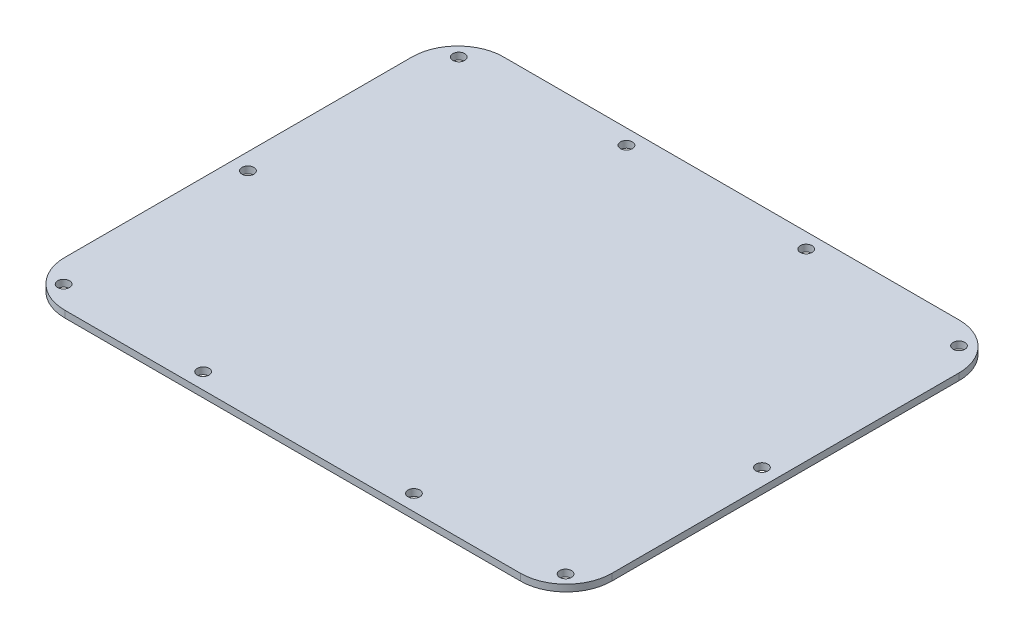
ISO-10303-21;
HEADER;
FILE_DESCRIPTION(('STEP AP214'),'2;1');
FILE_NAME('part.step','',(''),(''),'','','');
FILE_SCHEMA(('AUTOMOTIVE_DESIGN { 1 0 10303 214 1 1 1 1 }'));
ENDSEC;
DATA;
#1=APPLICATION_CONTEXT('core data for automotive mechanical design processes');
#2=APPLICATION_PROTOCOL_DEFINITION('international standard','automotive_design',2000,#1);
#3=PRODUCT_CONTEXT('',#1,'mechanical');
#4=PRODUCT('Part','Part','',(#3));
#5=PRODUCT_RELATED_PRODUCT_CATEGORY('part','',(#4));
#6=PRODUCT_DEFINITION_FORMATION('','',#4);
#7=PRODUCT_DEFINITION_CONTEXT('part definition',#1,'design');
#8=PRODUCT_DEFINITION('design','',#6,#7);
#9=PRODUCT_DEFINITION_SHAPE('','',#8);
#10=(LENGTH_UNIT() NAMED_UNIT(*) SI_UNIT(.MILLI.,.METRE.));
#11=(NAMED_UNIT(*) PLANE_ANGLE_UNIT() SI_UNIT($,.RADIAN.));
#12=(NAMED_UNIT(*) SI_UNIT($,.STERADIAN.) SOLID_ANGLE_UNIT());
#13=UNCERTAINTY_MEASURE_WITH_UNIT(LENGTH_MEASURE(1.E-05),#10,'distance_accuracy_value','');
#14=(GEOMETRIC_REPRESENTATION_CONTEXT(3) GLOBAL_UNCERTAINTY_ASSIGNED_CONTEXT((#13)) GLOBAL_UNIT_ASSIGNED_CONTEXT((#10,
#11,#12)) REPRESENTATION_CONTEXT('',''));
#15=CARTESIAN_POINT('',(0.,0.,0.));
#16=DIRECTION('',(0.,0.,1.));
#17=DIRECTION('',(1.,0.,0.));
#18=AXIS2_PLACEMENT_3D('',#15,#16,#17);
#19=CARTESIAN_POINT('',(-106.7689,3.175,81.3689000000001));
#20=DIRECTION('',(0.,-1.,0.));
#21=DIRECTION('',(0.,0.,-1.));
#22=AXIS2_PLACEMENT_3D('',#19,#20,#21);
#23=PLANE('',#22);
#24=CARTESIAN_POINT('',(-106.7689,3.175,81.3689000000001));
#25=DIRECTION('',(0.,1.,0.));
#26=DIRECTION('',(0.,0.,-1.));
#27=AXIS2_PLACEMENT_3D('',#24,#25,#26);
#28=CIRCLE('',#27,21.4376);
#29=CARTESIAN_POINT('',(-128.2065,3.175,81.3688999999999));
#30=VERTEX_POINT('',#29);
#31=CARTESIAN_POINT('',(-106.7689,3.175,102.8065));
#32=VERTEX_POINT('',#31);
#33=EDGE_CURVE('E170',#30,#32,#28,.T.);
#34=ORIENTED_EDGE('',*,*,#33,.T.);
#35=DIRECTION('',(1.,0.,0.));
#36=VECTOR('',#35,1.);
#37=CARTESIAN_POINT('',(-106.7689,3.175,102.8065));
#38=LINE('',#37,#36);
#39=CARTESIAN_POINT('',(106.7689,3.175,102.8065));
#40=VERTEX_POINT('',#39);
#41=EDGE_CURVE('E106',#32,#40,#38,.T.);
#42=ORIENTED_EDGE('',*,*,#41,.T.);
#43=CARTESIAN_POINT('',(106.7689,3.175,81.3689000000001));
#44=DIRECTION('',(0.,1.,0.));
#45=DIRECTION('',(0.,0.,1.));
#46=AXIS2_PLACEMENT_3D('',#43,#44,#45);
#47=CIRCLE('',#46,21.4376);
#48=CARTESIAN_POINT('',(128.2065,3.175,81.3688999999999));
#49=VERTEX_POINT('',#48);
#50=EDGE_CURVE('E191',#40,#49,#47,.T.);
#51=ORIENTED_EDGE('',*,*,#50,.T.);
#52=DIRECTION('',(0.,0.,-1.));
#53=VECTOR('',#52,1.);
#54=CARTESIAN_POINT('',(128.2065,3.175,81.3688999999999));
#55=LINE('',#54,#53);
#56=CARTESIAN_POINT('',(128.2065,3.175,-81.3688999999998));
#57=VERTEX_POINT('',#56);
#58=EDGE_CURVE('E205',#49,#57,#55,.T.);
#59=ORIENTED_EDGE('',*,*,#58,.T.);
#60=CARTESIAN_POINT('',(106.7689,3.175,-81.3689));
#61=DIRECTION('',(0.,1.,0.));
#62=DIRECTION('',(0.,0.,-1.));
#63=AXIS2_PLACEMENT_3D('',#60,#61,#62);
#64=CIRCLE('',#63,21.4376);
#65=CARTESIAN_POINT('',(106.7689,3.175,-102.8065));
#66=VERTEX_POINT('',#65);
#67=EDGE_CURVE('E125',#57,#66,#64,.T.);
#68=ORIENTED_EDGE('',*,*,#67,.T.);
#69=DIRECTION('',(-1.,0.,0.));
#70=VECTOR('',#69,1.);
#71=CARTESIAN_POINT('',(-106.7689,3.175,-102.8065));
#72=LINE('',#71,#70);
#73=CARTESIAN_POINT('',(-106.7689,3.175,-102.8065));
#74=VERTEX_POINT('',#73);
#75=EDGE_CURVE('E119',#66,#74,#72,.T.);
#76=ORIENTED_EDGE('',*,*,#75,.T.);
#77=CARTESIAN_POINT('',(-106.7689,3.175,-81.3689));
#78=DIRECTION('',(0.,1.,0.));
#79=DIRECTION('',(0.,0.,-1.));
#80=AXIS2_PLACEMENT_3D('',#77,#78,#79);
#81=CIRCLE('',#80,21.4376);
#82=CARTESIAN_POINT('',(-128.2065,3.175,-81.3688999999998));
#83=VERTEX_POINT('',#82);
#84=EDGE_CURVE('E123',#74,#83,#81,.T.);
#85=ORIENTED_EDGE('',*,*,#84,.T.);
#86=DIRECTION('',(0.,0.,1.));
#87=VECTOR('',#86,1.);
#88=CARTESIAN_POINT('',(-128.2065,3.175,81.3688999999999));
#89=LINE('',#88,#87);
#90=EDGE_CURVE('E63',#83,#30,#89,.T.);
#91=ORIENTED_EDGE('',*,*,#90,.T.);
#92=EDGE_LOOP('',(#34,#42,#51,#59,#68,#76,#85,#91));
#93=FACE_BOUND('',#92,.T.);
#94=CARTESIAN_POINT('',(42.1132,3.175,-95.7453));
#95=DIRECTION('',(0.,1.,0.));
#96=DIRECTION('',(0.,0.,1.));
#97=AXIS2_PLACEMENT_3D('',#94,#95,#96);
#98=CIRCLE('',#97,2.7813);
#99=CARTESIAN_POINT('',(42.1132,3.175,-92.964));
#100=VERTEX_POINT('',#99);
#101=EDGE_CURVE('E152',#100,#100,#98,.T.);
#102=ORIENTED_EDGE('',*,*,#101,.F.);
#103=EDGE_LOOP('',(#102));
#104=FACE_BOUND('',#103,.T.);
#105=CARTESIAN_POINT('',(117.221,3.175,-92.2909));
#106=DIRECTION('',(0.,1.,0.));
#107=DIRECTION('',(0.,0.,1.));
#108=AXIS2_PLACEMENT_3D('',#105,#106,#107);
#109=CIRCLE('',#108,2.7813);
#110=CARTESIAN_POINT('',(117.221,3.175,-89.5096));
#111=VERTEX_POINT('',#110);
#112=EDGE_CURVE('E219',#111,#111,#109,.T.);
#113=ORIENTED_EDGE('',*,*,#112,.F.);
#114=EDGE_LOOP('',(#113));
#115=FACE_BOUND('',#114,.T.);
#116=CARTESIAN_POINT('',(117.6274,3.175,92.5195));
#117=DIRECTION('',(0.,1.,0.));
#118=DIRECTION('',(0.,0.,1.));
#119=AXIS2_PLACEMENT_3D('',#116,#117,#118);
#120=CIRCLE('',#119,2.7813);
#121=CARTESIAN_POINT('',(117.6274,3.175,95.3008));
#122=VERTEX_POINT('',#121);
#123=EDGE_CURVE('E227',#122,#122,#120,.T.);
#124=ORIENTED_EDGE('',*,*,#123,.F.);
#125=EDGE_LOOP('',(#124));
#126=FACE_BOUND('',#125,.T.);
#127=CARTESIAN_POINT('',(120.4468,3.175,3.3147));
#128=DIRECTION('',(0.,1.,0.));
#129=DIRECTION('',(0.,0.,1.));
#130=AXIS2_PLACEMENT_3D('',#127,#128,#129);
#131=CIRCLE('',#130,2.7813);
#132=CARTESIAN_POINT('',(120.4468,3.175,6.096));
#133=VERTEX_POINT('',#132);
#134=EDGE_CURVE('E235',#133,#133,#131,.T.);
#135=ORIENTED_EDGE('',*,*,#134,.F.);
#136=EDGE_LOOP('',(#135));
#137=FACE_BOUND('',#136,.T.);
#138=CARTESIAN_POINT('',(49.403,3.175,95.3643));
#139=DIRECTION('',(0.,1.,0.));
#140=DIRECTION('',(0.,0.,1.));
#141=AXIS2_PLACEMENT_3D('',#138,#139,#140);
#142=CIRCLE('',#141,2.7813);
#143=CARTESIAN_POINT('',(49.403,3.175,98.1456));
#144=VERTEX_POINT('',#143);
#145=EDGE_CURVE('E243',#144,#144,#142,.T.);
#146=ORIENTED_EDGE('',*,*,#145,.F.);
#147=EDGE_LOOP('',(#146));
#148=FACE_BOUND('',#147,.T.);
#149=CARTESIAN_POINT('',(-49.4030000000002,3.175,95.3643));
#150=DIRECTION('',(0.,1.,0.));
#151=DIRECTION('',(0.,0.,-1.));
#152=AXIS2_PLACEMENT_3D('',#149,#150,#151);
#153=CIRCLE('',#152,2.7813);
#154=CARTESIAN_POINT('',(-49.4030000000002,3.175,92.583));
#155=VERTEX_POINT('',#154);
#156=EDGE_CURVE('E251',#155,#155,#153,.T.);
#157=ORIENTED_EDGE('',*,*,#156,.F.);
#158=EDGE_LOOP('',(#157));
#159=FACE_BOUND('',#158,.T.);
#160=CARTESIAN_POINT('',(-117.6274,3.175,92.5195));
#161=DIRECTION('',(0.,1.,0.));
#162=DIRECTION('',(0.,0.,-1.));
#163=AXIS2_PLACEMENT_3D('',#160,#161,#162);
#164=CIRCLE('',#163,2.7813);
#165=CARTESIAN_POINT('',(-117.6274,3.175,89.7381999999999));
#166=VERTEX_POINT('',#165);
#167=EDGE_CURVE('E259',#166,#166,#164,.T.);
#168=ORIENTED_EDGE('',*,*,#167,.F.);
#169=EDGE_LOOP('',(#168));
#170=FACE_BOUND('',#169,.T.);
#171=CARTESIAN_POINT('',(-120.4468,3.175,3.3147));
#172=DIRECTION('',(0.,1.,0.));
#173=DIRECTION('',(0.,0.,-1.));
#174=AXIS2_PLACEMENT_3D('',#171,#172,#173);
#175=CIRCLE('',#174,2.7813);
#176=CARTESIAN_POINT('',(-120.4468,3.175,0.533400000000007));
#177=VERTEX_POINT('',#176);
#178=EDGE_CURVE('E267',#177,#177,#175,.T.);
#179=ORIENTED_EDGE('',*,*,#178,.F.);
#180=EDGE_LOOP('',(#179));
#181=FACE_BOUND('',#180,.T.);
#182=CARTESIAN_POINT('',(-117.221,3.175,-92.2908999999999));
#183=DIRECTION('',(0.,1.,0.));
#184=DIRECTION('',(0.,0.,-1.));
#185=AXIS2_PLACEMENT_3D('',#182,#183,#184);
#186=CIRCLE('',#185,2.7813);
#187=CARTESIAN_POINT('',(-117.221,3.175,-95.0721999999999));
#188=VERTEX_POINT('',#187);
#189=EDGE_CURVE('E275',#188,#188,#186,.T.);
#190=ORIENTED_EDGE('',*,*,#189,.F.);
#191=EDGE_LOOP('',(#190));
#192=FACE_BOUND('',#191,.T.);
#193=CARTESIAN_POINT('',(-42.1132000000002,3.175,-95.7452999999999));
#194=DIRECTION('',(0.,1.,0.));
#195=DIRECTION('',(0.,0.,-1.));
#196=AXIS2_PLACEMENT_3D('',#193,#194,#195);
#197=CIRCLE('',#196,2.7813);
#198=CARTESIAN_POINT('',(-42.1132000000002,3.175,-98.5265999999999));
#199=VERTEX_POINT('',#198);
#200=EDGE_CURVE('E283',#199,#199,#197,.T.);
#201=ORIENTED_EDGE('',*,*,#200,.F.);
#202=EDGE_LOOP('',(#201));
#203=FACE_BOUND('',#202,.T.);
#204=ADVANCED_FACE('F45',(#93,#104,#115,#126,#137,#148,#159,#170,#181,#192,#203),#23,.F.);
#205=CARTESIAN_POINT('',(-106.7689,0.,81.3689000000001));
#206=DIRECTION('',(0.,-1.,0.));
#207=DIRECTION('',(0.,0.,-1.));
#208=AXIS2_PLACEMENT_3D('',#205,#206,#207);
#209=PLANE('',#208);
#210=CARTESIAN_POINT('',(-117.221,0.,-92.2908999999999));
#211=DIRECTION('',(0.,1.,0.));
#212=DIRECTION('',(0.,0.,-1.));
#213=AXIS2_PLACEMENT_3D('',#210,#211,#212);
#214=CIRCLE('',#213,2.7813);
#215=CARTESIAN_POINT('',(-117.221,0.,-95.0721999999999));
#216=VERTEX_POINT('',#215);
#217=EDGE_CURVE('E279',#216,#216,#214,.T.);
#218=ORIENTED_EDGE('',*,*,#217,.T.);
#219=EDGE_LOOP('',(#218));
#220=FACE_BOUND('',#219,.T.);
#221=CARTESIAN_POINT('',(-117.6274,0.,92.5195));
#222=DIRECTION('',(0.,1.,0.));
#223=DIRECTION('',(0.,0.,-1.));
#224=AXIS2_PLACEMENT_3D('',#221,#222,#223);
#225=CIRCLE('',#224,2.7813);
#226=CARTESIAN_POINT('',(-117.6274,0.,89.7381999999999));
#227=VERTEX_POINT('',#226);
#228=EDGE_CURVE('E263',#227,#227,#225,.T.);
#229=ORIENTED_EDGE('',*,*,#228,.T.);
#230=EDGE_LOOP('',(#229));
#231=FACE_BOUND('',#230,.T.);
#232=CARTESIAN_POINT('',(49.403,0.,95.3643));
#233=DIRECTION('',(0.,1.,0.));
#234=DIRECTION('',(0.,0.,1.));
#235=AXIS2_PLACEMENT_3D('',#232,#233,#234);
#236=CIRCLE('',#235,2.7813);
#237=CARTESIAN_POINT('',(49.403,0.,98.1456));
#238=VERTEX_POINT('',#237);
#239=EDGE_CURVE('E247',#238,#238,#236,.T.);
#240=ORIENTED_EDGE('',*,*,#239,.T.);
#241=EDGE_LOOP('',(#240));
#242=FACE_BOUND('',#241,.T.);
#243=CARTESIAN_POINT('',(117.6274,0.,92.5195));
#244=DIRECTION('',(0.,1.,0.));
#245=DIRECTION('',(0.,0.,1.));
#246=AXIS2_PLACEMENT_3D('',#243,#244,#245);
#247=CIRCLE('',#246,2.7813);
#248=CARTESIAN_POINT('',(117.6274,0.,95.3008));
#249=VERTEX_POINT('',#248);
#250=EDGE_CURVE('E231',#249,#249,#247,.T.);
#251=ORIENTED_EDGE('',*,*,#250,.T.);
#252=EDGE_LOOP('',(#251));
#253=FACE_BOUND('',#252,.T.);
#254=CARTESIAN_POINT('',(42.1132,0.,-95.7453));
#255=DIRECTION('',(0.,1.,0.));
#256=DIRECTION('',(0.,0.,1.));
#257=AXIS2_PLACEMENT_3D('',#254,#255,#256);
#258=CIRCLE('',#257,2.7813);
#259=CARTESIAN_POINT('',(42.1132,0.,-92.964));
#260=VERTEX_POINT('',#259);
#261=EDGE_CURVE('E215',#260,#260,#258,.T.);
#262=ORIENTED_EDGE('',*,*,#261,.T.);
#263=EDGE_LOOP('',(#262));
#264=FACE_BOUND('',#263,.T.);
#265=CARTESIAN_POINT('',(-106.7689,0.,81.3689000000001));
#266=DIRECTION('',(0.,1.,0.));
#267=DIRECTION('',(0.,0.,-1.));
#268=AXIS2_PLACEMENT_3D('',#265,#266,#267);
#269=CIRCLE('',#268,21.4376);
#270=CARTESIAN_POINT('',(-128.2065,0.,81.3688999999999));
#271=VERTEX_POINT('',#270);
#272=CARTESIAN_POINT('',(-106.7689,0.,102.8065));
#273=VERTEX_POINT('',#272);
#274=EDGE_CURVE('E147',#271,#273,#269,.T.);
#275=ORIENTED_EDGE('',*,*,#274,.F.);
#276=DIRECTION('',(0.,0.,1.));
#277=VECTOR('',#276,1.);
#278=CARTESIAN_POINT('',(-128.2065,0.,81.3688999999999));
#279=LINE('',#278,#277);
#280=CARTESIAN_POINT('',(-128.2065,0.,-81.3688999999998));
#281=VERTEX_POINT('',#280);
#282=EDGE_CURVE('E98',#281,#271,#279,.T.);
#283=ORIENTED_EDGE('',*,*,#282,.F.);
#284=CARTESIAN_POINT('',(-106.7689,0.,-81.3689));
#285=DIRECTION('',(0.,1.,0.));
#286=DIRECTION('',(0.,0.,-1.));
#287=AXIS2_PLACEMENT_3D('',#284,#285,#286);
#288=CIRCLE('',#287,21.4376);
#289=CARTESIAN_POINT('',(-106.7689,0.,-102.8065));
#290=VERTEX_POINT('',#289);
#291=EDGE_CURVE('E92',#290,#281,#288,.T.);
#292=ORIENTED_EDGE('',*,*,#291,.F.);
#293=DIRECTION('',(-1.,0.,0.));
#294=VECTOR('',#293,1.);
#295=CARTESIAN_POINT('',(-106.7689,0.,-102.8065));
#296=LINE('',#295,#294);
#297=CARTESIAN_POINT('',(106.7689,0.,-102.8065));
#298=VERTEX_POINT('',#297);
#299=EDGE_CURVE('E134',#298,#290,#296,.T.);
#300=ORIENTED_EDGE('',*,*,#299,.F.);
#301=CARTESIAN_POINT('',(106.7689,0.,-81.3689));
#302=DIRECTION('',(0.,1.,0.));
#303=DIRECTION('',(0.,0.,-1.));
#304=AXIS2_PLACEMENT_3D('',#301,#302,#303);
#305=CIRCLE('',#304,21.4376);
#306=CARTESIAN_POINT('',(128.2065,0.,-81.3688999999998));
#307=VERTEX_POINT('',#306);
#308=EDGE_CURVE('E161',#307,#298,#305,.T.);
#309=ORIENTED_EDGE('',*,*,#308,.F.);
#310=DIRECTION('',(0.,0.,-1.));
#311=VECTOR('',#310,1.);
#312=CARTESIAN_POINT('',(128.2065,0.,81.3688999999999));
#313=LINE('',#312,#311);
#314=CARTESIAN_POINT('',(128.2065,0.,81.3688999999999));
#315=VERTEX_POINT('',#314);
#316=EDGE_CURVE('E158',#315,#307,#313,.T.);
#317=ORIENTED_EDGE('',*,*,#316,.F.);
#318=CARTESIAN_POINT('',(106.7689,0.,81.3689000000001));
#319=DIRECTION('',(0.,1.,0.));
#320=DIRECTION('',(0.,0.,1.));
#321=AXIS2_PLACEMENT_3D('',#318,#319,#320);
#322=CIRCLE('',#321,21.4376);
#323=CARTESIAN_POINT('',(106.7689,0.,102.8065));
#324=VERTEX_POINT('',#323);
#325=EDGE_CURVE('E155',#324,#315,#322,.T.);
#326=ORIENTED_EDGE('',*,*,#325,.F.);
#327=DIRECTION('',(1.,0.,0.));
#328=VECTOR('',#327,1.);
#329=CARTESIAN_POINT('',(-106.7689,0.,102.8065));
#330=LINE('',#329,#328);
#331=EDGE_CURVE('E151',#273,#324,#330,.T.);
#332=ORIENTED_EDGE('',*,*,#331,.F.);
#333=EDGE_LOOP('',(#275,#283,#292,#300,#309,#317,#326,#332));
#334=FACE_BOUND('',#333,.T.);
#335=CARTESIAN_POINT('',(117.221,0.,-92.2909));
#336=DIRECTION('',(0.,1.,0.));
#337=DIRECTION('',(0.,0.,1.));
#338=AXIS2_PLACEMENT_3D('',#335,#336,#337);
#339=CIRCLE('',#338,2.7813);
#340=CARTESIAN_POINT('',(117.221,0.,-89.5096));
#341=VERTEX_POINT('',#340);
#342=EDGE_CURVE('E223',#341,#341,#339,.T.);
#343=ORIENTED_EDGE('',*,*,#342,.T.);
#344=EDGE_LOOP('',(#343));
#345=FACE_BOUND('',#344,.T.);
#346=CARTESIAN_POINT('',(120.4468,0.,3.3147));
#347=DIRECTION('',(0.,1.,0.));
#348=DIRECTION('',(0.,0.,1.));
#349=AXIS2_PLACEMENT_3D('',#346,#347,#348);
#350=CIRCLE('',#349,2.7813);
#351=CARTESIAN_POINT('',(120.4468,0.,6.096));
#352=VERTEX_POINT('',#351);
#353=EDGE_CURVE('E239',#352,#352,#350,.T.);
#354=ORIENTED_EDGE('',*,*,#353,.T.);
#355=EDGE_LOOP('',(#354));
#356=FACE_BOUND('',#355,.T.);
#357=CARTESIAN_POINT('',(-49.4030000000002,0.,95.3643));
#358=DIRECTION('',(0.,1.,0.));
#359=DIRECTION('',(0.,0.,-1.));
#360=AXIS2_PLACEMENT_3D('',#357,#358,#359);
#361=CIRCLE('',#360,2.7813);
#362=CARTESIAN_POINT('',(-49.4030000000002,0.,92.583));
#363=VERTEX_POINT('',#362);
#364=EDGE_CURVE('E255',#363,#363,#361,.T.);
#365=ORIENTED_EDGE('',*,*,#364,.T.);
#366=EDGE_LOOP('',(#365));
#367=FACE_BOUND('',#366,.T.);
#368=CARTESIAN_POINT('',(-120.4468,0.,3.3147));
#369=DIRECTION('',(0.,1.,0.));
#370=DIRECTION('',(0.,0.,-1.));
#371=AXIS2_PLACEMENT_3D('',#368,#369,#370);
#372=CIRCLE('',#371,2.7813);
#373=CARTESIAN_POINT('',(-120.4468,0.,0.533400000000007));
#374=VERTEX_POINT('',#373);
#375=EDGE_CURVE('E271',#374,#374,#372,.T.);
#376=ORIENTED_EDGE('',*,*,#375,.T.);
#377=EDGE_LOOP('',(#376));
#378=FACE_BOUND('',#377,.T.);
#379=CARTESIAN_POINT('',(-42.1132000000002,0.,-95.7452999999999));
#380=DIRECTION('',(0.,1.,0.));
#381=DIRECTION('',(0.,0.,-1.));
#382=AXIS2_PLACEMENT_3D('',#379,#380,#381);
#383=CIRCLE('',#382,2.7813);
#384=CARTESIAN_POINT('',(-42.1132000000002,0.,-98.5265999999999));
#385=VERTEX_POINT('',#384);
#386=EDGE_CURVE('E287',#385,#385,#383,.T.);
#387=ORIENTED_EDGE('',*,*,#386,.T.);
#388=EDGE_LOOP('',(#387));
#389=FACE_BOUND('',#388,.T.);
#390=ADVANCED_FACE('F195',(#220,#231,#242,#253,#264,#334,#345,#356,#367,#378,#389),#209,.T.);
#391=CARTESIAN_POINT('',(-106.7689,3.175,81.3689000000001));
#392=DIRECTION('',(0.,-1.,0.));
#393=DIRECTION('',(0.,0.,-1.));
#394=AXIS2_PLACEMENT_3D('',#391,#392,#393);
#395=CYLINDRICAL_SURFACE('',#394,21.4376);
#396=ORIENTED_EDGE('',*,*,#274,.T.);
#397=DIRECTION('',(0.,-1.,0.));
#398=VECTOR('',#397,1.);
#399=CARTESIAN_POINT('',(-106.7689,3.175,102.8065));
#400=LINE('',#399,#398);
#401=EDGE_CURVE('E11',#32,#273,#400,.T.);
#402=ORIENTED_EDGE('',*,*,#401,.F.);
#403=ORIENTED_EDGE('',*,*,#33,.F.);
#404=DIRECTION('',(0.,-1.,0.));
#405=VECTOR('',#404,1.);
#406=CARTESIAN_POINT('',(-128.2065,3.175,81.3688999999999));
#407=LINE('',#406,#405);
#408=EDGE_CURVE('E143',#30,#271,#407,.T.);
#409=ORIENTED_EDGE('',*,*,#408,.T.);
#410=EDGE_LOOP('',(#396,#402,#403,#409));
#411=FACE_BOUND('',#410,.T.);
#412=ADVANCED_FACE('F47',(#411),#395,.T.);
#413=CARTESIAN_POINT('',(-106.7689,3.175,102.8065));
#414=DIRECTION('',(0.,0.,-1.));
#415=DIRECTION('',(-1.,0.,0.));
#416=AXIS2_PLACEMENT_3D('',#413,#414,#415);
#417=PLANE('',#416);
#418=ORIENTED_EDGE('',*,*,#331,.T.);
#419=DIRECTION('',(0.,-1.,0.));
#420=VECTOR('',#419,1.);
#421=CARTESIAN_POINT('',(106.7689,3.175,102.8065));
#422=LINE('',#421,#420);
#423=EDGE_CURVE('E55',#40,#324,#422,.T.);
#424=ORIENTED_EDGE('',*,*,#423,.F.);
#425=ORIENTED_EDGE('',*,*,#41,.F.);
#426=ORIENTED_EDGE('',*,*,#401,.T.);
#427=EDGE_LOOP('',(#418,#424,#425,#426));
#428=FACE_BOUND('',#427,.T.);
#429=ADVANCED_FACE('F321',(#428),#417,.F.);
#430=CARTESIAN_POINT('',(106.7689,3.175,81.3689000000001));
#431=DIRECTION('',(0.,-1.,0.));
#432=DIRECTION('',(0.,0.,-1.));
#433=AXIS2_PLACEMENT_3D('',#430,#431,#432);
#434=CYLINDRICAL_SURFACE('',#433,21.4376);
#435=ORIENTED_EDGE('',*,*,#325,.T.);
#436=DIRECTION('',(0.,-1.,0.));
#437=VECTOR('',#436,1.);
#438=CARTESIAN_POINT('',(128.2065,3.175,81.3688999999999));
#439=LINE('',#438,#437);
#440=EDGE_CURVE('E181',#49,#315,#439,.T.);
#441=ORIENTED_EDGE('',*,*,#440,.F.);
#442=ORIENTED_EDGE('',*,*,#50,.F.);
#443=ORIENTED_EDGE('',*,*,#423,.T.);
#444=EDGE_LOOP('',(#435,#441,#442,#443));
#445=FACE_BOUND('',#444,.T.);
#446=ADVANCED_FACE('F189',(#445),#434,.T.);
#447=CARTESIAN_POINT('',(128.2065,3.175,81.3688999999999));
#448=DIRECTION('',(-1.,0.,0.));
#449=DIRECTION('',(0.,0.,1.));
#450=AXIS2_PLACEMENT_3D('',#447,#448,#449);
#451=PLANE('',#450);
#452=ORIENTED_EDGE('',*,*,#316,.T.);
#453=DIRECTION('',(0.,-1.,0.));
#454=VECTOR('',#453,1.);
#455=CARTESIAN_POINT('',(128.2065,3.175,-81.3688999999998));
#456=LINE('',#455,#454);
#457=EDGE_CURVE('E177',#57,#307,#456,.T.);
#458=ORIENTED_EDGE('',*,*,#457,.F.);
#459=ORIENTED_EDGE('',*,*,#58,.F.);
#460=ORIENTED_EDGE('',*,*,#440,.T.);
#461=EDGE_LOOP('',(#452,#458,#459,#460));
#462=FACE_BOUND('',#461,.T.);
#463=ADVANCED_FACE('F200',(#462),#451,.F.);
#464=CARTESIAN_POINT('',(106.7689,3.175,-81.3689));
#465=DIRECTION('',(0.,-1.,0.));
#466=DIRECTION('',(0.,0.,-1.));
#467=AXIS2_PLACEMENT_3D('',#464,#465,#466);
#468=CYLINDRICAL_SURFACE('',#467,21.4376);
#469=ORIENTED_EDGE('',*,*,#308,.T.);
#470=DIRECTION('',(0.,-1.,0.));
#471=VECTOR('',#470,1.);
#472=CARTESIAN_POINT('',(106.7689,3.175,-102.8065));
#473=LINE('',#472,#471);
#474=EDGE_CURVE('E136',#66,#298,#473,.T.);
#475=ORIENTED_EDGE('',*,*,#474,.F.);
#476=ORIENTED_EDGE('',*,*,#67,.F.);
#477=ORIENTED_EDGE('',*,*,#457,.T.);
#478=EDGE_LOOP('',(#469,#475,#476,#477));
#479=FACE_BOUND('',#478,.T.);
#480=ADVANCED_FACE('F203',(#479),#468,.T.);
#481=CARTESIAN_POINT('',(-106.7689,3.175,-102.8065));
#482=DIRECTION('',(0.,0.,1.));
#483=DIRECTION('',(1.,0.,0.));
#484=AXIS2_PLACEMENT_3D('',#481,#482,#483);
#485=PLANE('',#484);
#486=ORIENTED_EDGE('',*,*,#299,.T.);
#487=DIRECTION('',(0.,-1.,0.));
#488=VECTOR('',#487,1.);
#489=CARTESIAN_POINT('',(-106.7689,3.175,-102.8065));
#490=LINE('',#489,#488);
#491=EDGE_CURVE('E131',#74,#290,#490,.T.);
#492=ORIENTED_EDGE('',*,*,#491,.F.);
#493=ORIENTED_EDGE('',*,*,#75,.F.);
#494=ORIENTED_EDGE('',*,*,#474,.T.);
#495=EDGE_LOOP('',(#486,#492,#493,#494));
#496=FACE_BOUND('',#495,.T.);
#497=ADVANCED_FACE('F132',(#496),#485,.F.);
#498=CARTESIAN_POINT('',(-106.7689,3.175,-81.3689));
#499=DIRECTION('',(0.,-1.,0.));
#500=DIRECTION('',(0.,0.,-1.));
#501=AXIS2_PLACEMENT_3D('',#498,#499,#500);
#502=CYLINDRICAL_SURFACE('',#501,21.4376);
#503=ORIENTED_EDGE('',*,*,#291,.T.);
#504=DIRECTION('',(0.,-1.,0.));
#505=VECTOR('',#504,1.);
#506=CARTESIAN_POINT('',(-128.2065,3.175,-81.3688999999998));
#507=LINE('',#506,#505);
#508=EDGE_CURVE('E137',#83,#281,#507,.T.);
#509=ORIENTED_EDGE('',*,*,#508,.F.);
#510=ORIENTED_EDGE('',*,*,#84,.F.);
#511=ORIENTED_EDGE('',*,*,#491,.T.);
#512=EDGE_LOOP('',(#503,#509,#510,#511));
#513=FACE_BOUND('',#512,.T.);
#514=ADVANCED_FACE('F139',(#513),#502,.T.);
#515=CARTESIAN_POINT('',(-128.2065,3.175,81.3688999999999));
#516=DIRECTION('',(1.,0.,0.));
#517=DIRECTION('',(0.,0.,-1.));
#518=AXIS2_PLACEMENT_3D('',#515,#516,#517);
#519=PLANE('',#518);
#520=ORIENTED_EDGE('',*,*,#282,.T.);
#521=ORIENTED_EDGE('',*,*,#408,.F.);
#522=ORIENTED_EDGE('',*,*,#90,.F.);
#523=ORIENTED_EDGE('',*,*,#508,.T.);
#524=EDGE_LOOP('',(#520,#521,#522,#523));
#525=FACE_BOUND('',#524,.T.);
#526=ADVANCED_FACE('F309',(#525),#519,.F.);
#527=CARTESIAN_POINT('',(42.1132,3.175,-95.7453));
#528=DIRECTION('',(0.,-1.,0.));
#529=DIRECTION('',(0.,0.,-1.));
#530=AXIS2_PLACEMENT_3D('',#527,#528,#529);
#531=CYLINDRICAL_SURFACE('',#530,2.7813);
#532=ORIENTED_EDGE('',*,*,#101,.T.);
#533=EDGE_LOOP('',(#532));
#534=FACE_BOUND('',#533,.T.);
#535=ORIENTED_EDGE('',*,*,#261,.F.);
#536=EDGE_LOOP('',(#535));
#537=FACE_BOUND('',#536,.T.);
#538=ADVANCED_FACE('F306',(#534,#537),#531,.F.);
#539=CARTESIAN_POINT('',(117.221,3.175,-92.2909));
#540=DIRECTION('',(0.,-1.,0.));
#541=DIRECTION('',(0.,0.,-1.));
#542=AXIS2_PLACEMENT_3D('',#539,#540,#541);
#543=CYLINDRICAL_SURFACE('',#542,2.7813);
#544=ORIENTED_EDGE('',*,*,#112,.T.);
#545=EDGE_LOOP('',(#544));
#546=FACE_BOUND('',#545,.T.);
#547=ORIENTED_EDGE('',*,*,#342,.F.);
#548=EDGE_LOOP('',(#547));
#549=FACE_BOUND('',#548,.T.);
#550=ADVANCED_FACE('F384',(#546,#549),#543,.F.);
#551=CARTESIAN_POINT('',(117.6274,3.175,92.5195));
#552=DIRECTION('',(0.,-1.,0.));
#553=DIRECTION('',(0.,0.,-1.));
#554=AXIS2_PLACEMENT_3D('',#551,#552,#553);
#555=CYLINDRICAL_SURFACE('',#554,2.7813);
#556=ORIENTED_EDGE('',*,*,#123,.T.);
#557=EDGE_LOOP('',(#556));
#558=FACE_BOUND('',#557,.T.);
#559=ORIENTED_EDGE('',*,*,#250,.F.);
#560=EDGE_LOOP('',(#559));
#561=FACE_BOUND('',#560,.T.);
#562=ADVANCED_FACE('F392',(#558,#561),#555,.F.);
#563=CARTESIAN_POINT('',(120.4468,3.175,3.3147));
#564=DIRECTION('',(0.,-1.,0.));
#565=DIRECTION('',(0.,0.,-1.));
#566=AXIS2_PLACEMENT_3D('',#563,#564,#565);
#567=CYLINDRICAL_SURFACE('',#566,2.7813);
#568=ORIENTED_EDGE('',*,*,#134,.T.);
#569=EDGE_LOOP('',(#568));
#570=FACE_BOUND('',#569,.T.);
#571=ORIENTED_EDGE('',*,*,#353,.F.);
#572=EDGE_LOOP('',(#571));
#573=FACE_BOUND('',#572,.T.);
#574=ADVANCED_FACE('F400',(#570,#573),#567,.F.);
#575=CARTESIAN_POINT('',(49.403,3.175,95.3643));
#576=DIRECTION('',(0.,-1.,0.));
#577=DIRECTION('',(0.,0.,-1.));
#578=AXIS2_PLACEMENT_3D('',#575,#576,#577);
#579=CYLINDRICAL_SURFACE('',#578,2.7813);
#580=ORIENTED_EDGE('',*,*,#145,.T.);
#581=EDGE_LOOP('',(#580));
#582=FACE_BOUND('',#581,.T.);
#583=ORIENTED_EDGE('',*,*,#239,.F.);
#584=EDGE_LOOP('',(#583));
#585=FACE_BOUND('',#584,.T.);
#586=ADVANCED_FACE('F409',(#582,#585),#579,.F.);
#587=CARTESIAN_POINT('',(-49.4030000000002,3.175,95.3643));
#588=DIRECTION('',(0.,-1.,0.));
#589=DIRECTION('',(0.,0.,-1.));
#590=AXIS2_PLACEMENT_3D('',#587,#588,#589);
#591=CYLINDRICAL_SURFACE('',#590,2.7813);
#592=ORIENTED_EDGE('',*,*,#156,.T.);
#593=EDGE_LOOP('',(#592));
#594=FACE_BOUND('',#593,.T.);
#595=ORIENTED_EDGE('',*,*,#364,.F.);
#596=EDGE_LOOP('',(#595));
#597=FACE_BOUND('',#596,.T.);
#598=ADVANCED_FACE('F418',(#594,#597),#591,.F.);
#599=CARTESIAN_POINT('',(-117.6274,3.175,92.5195));
#600=DIRECTION('',(0.,-1.,0.));
#601=DIRECTION('',(0.,0.,-1.));
#602=AXIS2_PLACEMENT_3D('',#599,#600,#601);
#603=CYLINDRICAL_SURFACE('',#602,2.7813);
#604=ORIENTED_EDGE('',*,*,#167,.T.);
#605=EDGE_LOOP('',(#604));
#606=FACE_BOUND('',#605,.T.);
#607=ORIENTED_EDGE('',*,*,#228,.F.);
#608=EDGE_LOOP('',(#607));
#609=FACE_BOUND('',#608,.T.);
#610=ADVANCED_FACE('F427',(#606,#609),#603,.F.);
#611=CARTESIAN_POINT('',(-120.4468,3.175,3.3147));
#612=DIRECTION('',(0.,-1.,0.));
#613=DIRECTION('',(0.,0.,-1.));
#614=AXIS2_PLACEMENT_3D('',#611,#612,#613);
#615=CYLINDRICAL_SURFACE('',#614,2.7813);
#616=ORIENTED_EDGE('',*,*,#178,.T.);
#617=EDGE_LOOP('',(#616));
#618=FACE_BOUND('',#617,.T.);
#619=ORIENTED_EDGE('',*,*,#375,.F.);
#620=EDGE_LOOP('',(#619));
#621=FACE_BOUND('',#620,.T.);
#622=ADVANCED_FACE('F436',(#618,#621),#615,.F.);
#623=CARTESIAN_POINT('',(-117.221,3.175,-92.2908999999999));
#624=DIRECTION('',(0.,-1.,0.));
#625=DIRECTION('',(0.,0.,-1.));
#626=AXIS2_PLACEMENT_3D('',#623,#624,#625);
#627=CYLINDRICAL_SURFACE('',#626,2.7813);
#628=ORIENTED_EDGE('',*,*,#189,.T.);
#629=EDGE_LOOP('',(#628));
#630=FACE_BOUND('',#629,.T.);
#631=ORIENTED_EDGE('',*,*,#217,.F.);
#632=EDGE_LOOP('',(#631));
#633=FACE_BOUND('',#632,.T.);
#634=ADVANCED_FACE('F445',(#630,#633),#627,.F.);
#635=CARTESIAN_POINT('',(-42.1132000000002,3.175,-95.7452999999999));
#636=DIRECTION('',(0.,-1.,0.));
#637=DIRECTION('',(0.,0.,-1.));
#638=AXIS2_PLACEMENT_3D('',#635,#636,#637);
#639=CYLINDRICAL_SURFACE('',#638,2.7813);
#640=ORIENTED_EDGE('',*,*,#200,.T.);
#641=EDGE_LOOP('',(#640));
#642=FACE_BOUND('',#641,.T.);
#643=ORIENTED_EDGE('',*,*,#386,.F.);
#644=EDGE_LOOP('',(#643));
#645=FACE_BOUND('',#644,.T.);
#646=ADVANCED_FACE('F295',(#642,#645),#639,.F.);
#647=CLOSED_SHELL('',(#204,#390,#412,#429,#446,#463,#480,#497,#514,#526,#538,#550,#562,#574,
#586,#598,#610,#622,#634,#646));
#648=MANIFOLD_SOLID_BREP('B2',#647);
#649=ADVANCED_BREP_SHAPE_REPRESENTATION('',(#18,#648),#14);
#650=SHAPE_DEFINITION_REPRESENTATION(#9,#649);
ENDSEC;
END-ISO-10303-21;
